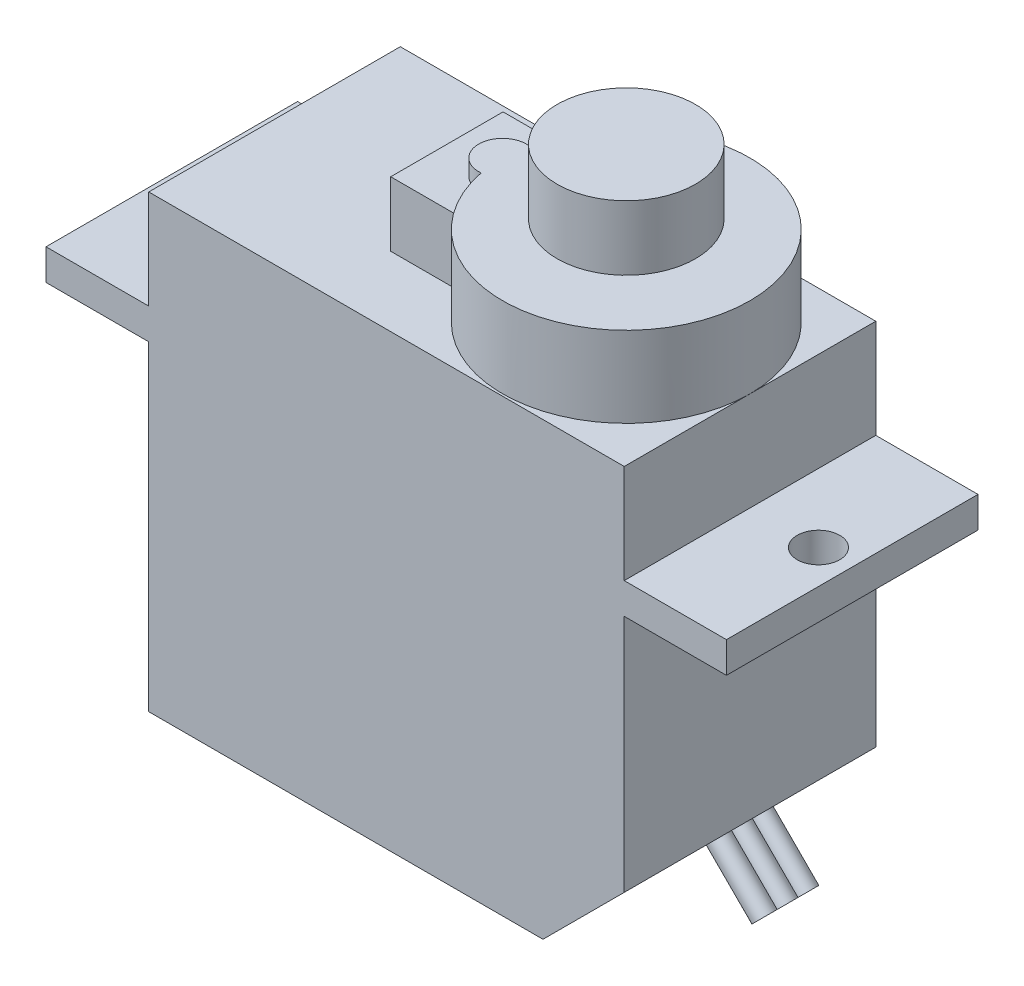
ISO-10303-21;
HEADER;
FILE_DESCRIPTION(('STEP AP214'),'2;1');
FILE_NAME('part.step','',(''),(''),'','','');
FILE_SCHEMA(('AUTOMOTIVE_DESIGN { 1 0 10303 214 1 1 1 1 }'));
ENDSEC;
DATA;
#1=APPLICATION_CONTEXT('core data for automotive mechanical design processes');
#2=APPLICATION_PROTOCOL_DEFINITION('international standard','automotive_design',2000,#1);
#3=PRODUCT_CONTEXT('',#1,'mechanical');
#4=PRODUCT('Part','Part','',(#3));
#5=PRODUCT_RELATED_PRODUCT_CATEGORY('part','',(#4));
#6=PRODUCT_DEFINITION_FORMATION('','',#4);
#7=PRODUCT_DEFINITION_CONTEXT('part definition',#1,'design');
#8=PRODUCT_DEFINITION('design','',#6,#7);
#9=PRODUCT_DEFINITION_SHAPE('','',#8);
#10=(LENGTH_UNIT() NAMED_UNIT(*) SI_UNIT(.MILLI.,.METRE.));
#11=(NAMED_UNIT(*) PLANE_ANGLE_UNIT() SI_UNIT($,.RADIAN.));
#12=(NAMED_UNIT(*) SI_UNIT($,.STERADIAN.) SOLID_ANGLE_UNIT());
#13=UNCERTAINTY_MEASURE_WITH_UNIT(LENGTH_MEASURE(1.E-05),#10,'distance_accuracy_value','');
#14=(GEOMETRIC_REPRESENTATION_CONTEXT(3) GLOBAL_UNCERTAINTY_ASSIGNED_CONTEXT((#13)) GLOBAL_UNIT_ASSIGNED_CONTEXT((#10,
#11,#12)) REPRESENTATION_CONTEXT('',''));
#15=CARTESIAN_POINT('',(0.,0.,0.));
#16=DIRECTION('',(0.,0.,1.));
#17=DIRECTION('',(1.,0.,0.));
#18=AXIS2_PLACEMENT_3D('',#15,#16,#17);
#19=CARTESIAN_POINT('',(19.12,0.,-12.2));
#20=DIRECTION('',(0.707106781186549,-0.707106781186546,0.));
#21=DIRECTION('',(0.707106781186546,0.707106781186549,0.));
#22=AXIS2_PLACEMENT_3D('',#19,#20,#21);
#23=PLANE('',#22);
#24=CARTESIAN_POINT('',(22.5615705813706,3.44157058137057,-6.1));
#25=DIRECTION('',(0.707106781186549,-0.707106781186546,0.));
#26=DIRECTION('',(0.707106781186546,0.707106781186549,0.));
#27=AXIS2_PLACEMENT_3D('',#24,#25,#26);
#28=CIRCLE('',#27,0.500000000000001);
#29=CARTESIAN_POINT('',(22.9151239719638,3.79512397196384,-6.1));
#30=VERTEX_POINT('',#29);
#31=EDGE_CURVE('E358',#30,#30,#28,.T.);
#32=ORIENTED_EDGE('',*,*,#31,.F.);
#33=EDGE_LOOP('',(#32));
#34=FACE_BOUND('',#33,.T.);
#35=DIRECTION('',(0.707106781186546,0.707106781186549,0.));
#36=VECTOR('',#35,1.);
#37=CARTESIAN_POINT('',(19.12,0.,0.));
#38=LINE('',#37,#36);
#39=CARTESIAN_POINT('',(19.12,0.,0.));
#40=VERTEX_POINT('',#39);
#41=CARTESIAN_POINT('',(23.06,3.94,0.));
#42=VERTEX_POINT('',#41);
#43=EDGE_CURVE('E305',#40,#42,#38,.T.);
#44=ORIENTED_EDGE('',*,*,#43,.F.);
#45=DIRECTION('',(0.,0.,1.));
#46=VECTOR('',#45,1.);
#47=CARTESIAN_POINT('',(19.12,0.,-12.2));
#48=LINE('',#47,#46);
#49=CARTESIAN_POINT('',(19.12,0.,-12.2));
#50=VERTEX_POINT('',#49);
#51=EDGE_CURVE('E327',#50,#40,#48,.T.);
#52=ORIENTED_EDGE('',*,*,#51,.F.);
#53=DIRECTION('',(0.707106781186546,0.707106781186549,0.));
#54=VECTOR('',#53,1.);
#55=CARTESIAN_POINT('',(19.12,0.,-12.2));
#56=LINE('',#55,#54);
#57=CARTESIAN_POINT('',(23.06,3.94,-12.2));
#58=VERTEX_POINT('',#57);
#59=EDGE_CURVE('E288',#50,#58,#56,.T.);
#60=ORIENTED_EDGE('',*,*,#59,.T.);
#61=DIRECTION('',(0.,0.,1.));
#62=VECTOR('',#61,1.);
#63=CARTESIAN_POINT('',(23.06,3.94,-12.2));
#64=LINE('',#63,#62);
#65=EDGE_CURVE('E324',#58,#42,#64,.T.);
#66=ORIENTED_EDGE('',*,*,#65,.T.);
#67=EDGE_LOOP('',(#44,#52,#60,#66));
#68=FACE_BOUND('',#67,.T.);
#69=CARTESIAN_POINT('',(22.5615705813706,3.44157058137056,-5.09));
#70=DIRECTION('',(0.707106781186549,-0.707106781186546,0.));
#71=DIRECTION('',(0.707106781186546,0.707106781186549,0.));
#72=AXIS2_PLACEMENT_3D('',#69,#70,#71);
#73=CIRCLE('',#72,0.500000000000001);
#74=CARTESIAN_POINT('',(22.9151239719638,3.79512397196384,-5.09));
#75=VERTEX_POINT('',#74);
#76=EDGE_CURVE('E351',#75,#75,#73,.T.);
#77=ORIENTED_EDGE('',*,*,#76,.F.);
#78=EDGE_LOOP('',(#77));
#79=FACE_BOUND('',#78,.T.);
#80=CARTESIAN_POINT('',(22.5615705813706,3.44157058137057,-7.11));
#81=DIRECTION('',(0.707106781186549,-0.707106781186546,0.));
#82=DIRECTION('',(0.707106781186546,0.707106781186549,0.));
#83=AXIS2_PLACEMENT_3D('',#80,#81,#82);
#84=CIRCLE('',#83,0.500000000000001);
#85=CARTESIAN_POINT('',(22.9151239719638,3.79512397196384,-7.11));
#86=VERTEX_POINT('',#85);
#87=EDGE_CURVE('E365',#86,#86,#84,.T.);
#88=ORIENTED_EDGE('',*,*,#87,.F.);
#89=EDGE_LOOP('',(#88));
#90=FACE_BOUND('',#89,.T.);
#91=ADVANCED_FACE('F40',(#34,#68,#79,#90),#23,.T.);
#92=CARTESIAN_POINT('',(17.06,28.51,-6.1));
#93=DIRECTION('',(0.,-1.,0.));
#94=DIRECTION('',(0.,0.,-1.));
#95=AXIS2_PLACEMENT_3D('',#92,#93,#94);
#96=CYLINDRICAL_SURFACE('',#95,2.345);
#97=CARTESIAN_POINT('',(17.06,25.74,-6.1));
#98=DIRECTION('',(0.,1.,0.));
#99=DIRECTION('',(0.,0.,1.));
#100=AXIS2_PLACEMENT_3D('',#97,#98,#99);
#101=CIRCLE('',#100,2.345);
#102=CARTESIAN_POINT('',(17.06,25.74,-3.755));
#103=VERTEX_POINT('',#102);
#104=EDGE_CURVE('E194',#103,#103,#101,.F.);
#105=ORIENTED_EDGE('',*,*,#104,.F.);
#106=EDGE_LOOP('',(#105));
#107=FACE_BOUND('',#106,.T.);
#108=CARTESIAN_POINT('',(17.06,26.18,-6.1));
#109=DIRECTION('',(0.,1.,0.));
#110=DIRECTION('',(0.,0.,1.));
#111=AXIS2_PLACEMENT_3D('',#108,#109,#110);
#112=CIRCLE('',#111,2.345);
#113=CARTESIAN_POINT('',(17.06,26.18,-3.755));
#114=VERTEX_POINT('',#113);
#115=EDGE_CURVE('E11',#114,#114,#112,.T.);
#116=ORIENTED_EDGE('',*,*,#115,.F.);
#117=EDGE_LOOP('',(#116));
#118=FACE_BOUND('',#117,.T.);
#119=ADVANCED_FACE('F382',(#107,#118),#96,.T.);
#120=CARTESIAN_POINT('',(17.06,25.74,-6.1));
#121=DIRECTION('',(0.,1.,0.));
#122=DIRECTION('',(0.,0.,1.));
#123=AXIS2_PLACEMENT_3D('',#120,#121,#122);
#124=PLANE('',#123);
#125=CARTESIAN_POINT('',(17.06,25.74,-6.1));
#126=DIRECTION('',(0.,1.,0.));
#127=DIRECTION('',(0.,0.,1.));
#128=AXIS2_PLACEMENT_3D('',#125,#126,#127);
#129=CIRCLE('',#128,6.);
#130=CARTESIAN_POINT('',(11.1721333333333,25.74,-4.94543249848458));
#131=VERTEX_POINT('',#130);
#132=CARTESIAN_POINT('',(11.1721333333333,25.74,-7.25456750151542));
#133=VERTEX_POINT('',#132);
#134=EDGE_CURVE('E273',#131,#133,#129,.T.);
#135=ORIENTED_EDGE('',*,*,#134,.T.);
#136=CARTESIAN_POINT('',(11.06,25.74,-6.1));
#137=DIRECTION('',(0.,1.,0.));
#138=DIRECTION('',(0.,0.,1.));
#139=AXIS2_PLACEMENT_3D('',#136,#137,#138);
#140=CIRCLE('',#139,1.16);
#141=EDGE_CURVE('E211',#133,#131,#140,.T.);
#142=ORIENTED_EDGE('',*,*,#141,.T.);
#143=EDGE_LOOP('',(#135,#142));
#144=FACE_BOUND('',#143,.T.);
#145=ORIENTED_EDGE('',*,*,#104,.T.);
#146=EDGE_LOOP('',(#145));
#147=FACE_BOUND('',#146,.T.);
#148=ADVANCED_FACE('F388',(#144,#147),#124,.T.);
#149=CARTESIAN_POINT('',(0.,21.83,-12.2));
#150=DIRECTION('',(0.,1.,0.));
#151=DIRECTION('',(0.,0.,1.));
#152=AXIS2_PLACEMENT_3D('',#149,#150,#151);
#153=PLANE('',#152);
#154=CARTESIAN_POINT('',(17.06,21.83,-6.1));
#155=DIRECTION('',(0.,1.,0.));
#156=DIRECTION('',(0.,0.,1.));
#157=AXIS2_PLACEMENT_3D('',#154,#155,#156);
#158=CIRCLE('',#157,6.);
#159=CARTESIAN_POINT('',(23.06,21.83,-6.1));
#160=VERTEX_POINT('',#159);
#161=CARTESIAN_POINT('',(11.7144995557011,21.83,-3.375));
#162=VERTEX_POINT('',#161);
#163=EDGE_CURVE('E277',#160,#162,#158,.F.);
#164=ORIENTED_EDGE('',*,*,#163,.T.);
#165=DIRECTION('',(-1.,0.,0.));
#166=VECTOR('',#165,1.);
#167=CARTESIAN_POINT('',(0.,21.83,-3.375));
#168=LINE('',#167,#166);
#169=CARTESIAN_POINT('',(8.36,21.83,-3.375));
#170=VERTEX_POINT('',#169);
#171=EDGE_CURVE('E209',#162,#170,#168,.T.);
#172=ORIENTED_EDGE('',*,*,#171,.T.);
#173=DIRECTION('',(0.,0.,-1.));
#174=VECTOR('',#173,1.);
#175=CARTESIAN_POINT('',(8.36,21.83,-12.2));
#176=LINE('',#175,#174);
#177=CARTESIAN_POINT('',(8.36,21.83,-8.825));
#178=VERTEX_POINT('',#177);
#179=EDGE_CURVE('E198',#170,#178,#176,.T.);
#180=ORIENTED_EDGE('',*,*,#179,.T.);
#181=DIRECTION('',(1.,0.,0.));
#182=VECTOR('',#181,1.);
#183=CARTESIAN_POINT('',(0.,21.83,-8.825));
#184=LINE('',#183,#182);
#185=CARTESIAN_POINT('',(11.7144995557011,21.83,-8.825));
#186=VERTEX_POINT('',#185);
#187=EDGE_CURVE('E206',#178,#186,#184,.T.);
#188=ORIENTED_EDGE('',*,*,#187,.T.);
#189=EDGE_CURVE('E276',#186,#160,#158,.F.);
#190=ORIENTED_EDGE('',*,*,#189,.T.);
#191=DIRECTION('',(0.,0.,1.));
#192=VECTOR('',#191,1.);
#193=CARTESIAN_POINT('',(23.06,21.83,-12.2));
#194=LINE('',#193,#192);
#195=CARTESIAN_POINT('',(23.06,21.83,-12.2));
#196=VERTEX_POINT('',#195);
#197=EDGE_CURVE('E320',#196,#160,#194,.T.);
#198=ORIENTED_EDGE('',*,*,#197,.F.);
#199=DIRECTION('',(-1.,0.,0.));
#200=VECTOR('',#199,1.);
#201=CARTESIAN_POINT('',(0.,21.83,-12.2));
#202=LINE('',#201,#200);
#203=CARTESIAN_POINT('',(0.,21.83,-12.2));
#204=VERTEX_POINT('',#203);
#205=EDGE_CURVE('E295',#196,#204,#202,.T.);
#206=ORIENTED_EDGE('',*,*,#205,.T.);
#207=DIRECTION('',(0.,0.,1.));
#208=VECTOR('',#207,1.);
#209=CARTESIAN_POINT('',(0.,21.83,-12.2));
#210=LINE('',#209,#208);
#211=CARTESIAN_POINT('',(0.,21.83,0.));
#212=VERTEX_POINT('',#211);
#213=EDGE_CURVE('E317',#204,#212,#210,.T.);
#214=ORIENTED_EDGE('',*,*,#213,.T.);
#215=DIRECTION('',(-1.,0.,0.));
#216=VECTOR('',#215,1.);
#217=CARTESIAN_POINT('',(0.,21.83,0.));
#218=LINE('',#217,#216);
#219=CARTESIAN_POINT('',(23.06,21.83,0.));
#220=VERTEX_POINT('',#219);
#221=EDGE_CURVE('E314',#220,#212,#218,.T.);
#222=ORIENTED_EDGE('',*,*,#221,.F.);
#223=EDGE_CURVE('E323',#160,#220,#194,.T.);
#224=ORIENTED_EDGE('',*,*,#223,.F.);
#225=EDGE_LOOP('',(#164,#172,#180,#188,#190,#198,#206,#214,#222,#224));
#226=FACE_BOUND('',#225,.T.);
#227=ADVANCED_FACE('F446',(#226),#153,.T.);
#228=CARTESIAN_POINT('',(17.06,25.74,-6.1));
#229=DIRECTION('',(0.,-1.,0.));
#230=DIRECTION('',(0.,0.,-1.));
#231=AXIS2_PLACEMENT_3D('',#228,#229,#230);
#232=CYLINDRICAL_SURFACE('',#231,6.);
#233=DIRECTION('',(0.,-1.,0.));
#234=VECTOR('',#233,1.);
#235=CARTESIAN_POINT('',(11.7144995557011,25.74,-8.825));
#236=LINE('',#235,#234);
#237=CARTESIAN_POINT('',(11.7144995557011,24.96,-8.825));
#238=VERTEX_POINT('',#237);
#239=EDGE_CURVE('E333',#238,#186,#236,.T.);
#240=ORIENTED_EDGE('',*,*,#239,.F.);
#241=CARTESIAN_POINT('',(17.06,24.96,-6.1));
#242=DIRECTION('',(0.,1.,0.));
#243=DIRECTION('',(0.,0.,1.));
#244=AXIS2_PLACEMENT_3D('',#241,#242,#243);
#245=CIRCLE('',#244,6.);
#246=CARTESIAN_POINT('',(11.1721333333333,24.96,-7.25456750151542));
#247=VERTEX_POINT('',#246);
#248=EDGE_CURVE('E201',#238,#247,#245,.T.);
#249=ORIENTED_EDGE('',*,*,#248,.T.);
#250=DIRECTION('',(0.,-1.,0.));
#251=VECTOR('',#250,1.);
#252=CARTESIAN_POINT('',(11.1721333333333,21.37,-7.25456750151542));
#253=LINE('',#252,#251);
#254=EDGE_CURVE('E214',#133,#247,#253,.T.);
#255=ORIENTED_EDGE('',*,*,#254,.F.);
#256=ORIENTED_EDGE('',*,*,#134,.F.);
#257=DIRECTION('',(0.,-1.,0.));
#258=VECTOR('',#257,1.);
#259=CARTESIAN_POINT('',(11.1721333333333,21.37,-4.94543249848458));
#260=LINE('',#259,#258);
#261=CARTESIAN_POINT('',(11.1721333333333,24.96,-4.94543249848458));
#262=VERTEX_POINT('',#261);
#263=EDGE_CURVE('E64',#262,#131,#260,.F.);
#264=ORIENTED_EDGE('',*,*,#263,.F.);
#265=CARTESIAN_POINT('',(11.7144995557011,24.96,-3.375));
#266=VERTEX_POINT('',#265);
#267=EDGE_CURVE('E57',#262,#266,#245,.T.);
#268=ORIENTED_EDGE('',*,*,#267,.T.);
#269=DIRECTION('',(0.,-1.,0.));
#270=VECTOR('',#269,1.);
#271=CARTESIAN_POINT('',(11.7144995557011,25.74,-3.375));
#272=LINE('',#271,#270);
#273=EDGE_CURVE('E184',#162,#266,#272,.F.);
#274=ORIENTED_EDGE('',*,*,#273,.F.);
#275=ORIENTED_EDGE('',*,*,#163,.F.);
#276=ORIENTED_EDGE('',*,*,#189,.F.);
#277=EDGE_LOOP('',(#240,#249,#255,#256,#264,#268,#274,#275,#276));
#278=FACE_BOUND('',#277,.T.);
#279=ADVANCED_FACE('F512',(#278),#232,.T.);
#280=CARTESIAN_POINT('',(0.,0.,-12.2));
#281=DIRECTION('',(-1.,0.,0.));
#282=DIRECTION('',(0.,0.,1.));
#283=AXIS2_PLACEMENT_3D('',#280,#281,#282);
#284=PLANE('',#283);
#285=DIRECTION('',(0.,0.,-1.));
#286=VECTOR('',#285,1.);
#287=CARTESIAN_POINT('',(0.,17.0352801000834,-12.2));
#288=LINE('',#287,#286);
#289=CARTESIAN_POINT('',(0.,17.0352801000834,0.));
#290=VERTEX_POINT('',#289);
#291=CARTESIAN_POINT('',(0.,17.0352801000834,-12.2));
#292=VERTEX_POINT('',#291);
#293=EDGE_CURVE('E271',#290,#292,#288,.T.);
#294=ORIENTED_EDGE('',*,*,#293,.F.);
#295=DIRECTION('',(0.,-1.,0.));
#296=VECTOR('',#295,1.);
#297=CARTESIAN_POINT('',(0.,0.,0.));
#298=LINE('',#297,#296);
#299=EDGE_CURVE('E299',#212,#290,#298,.T.);
#300=ORIENTED_EDGE('',*,*,#299,.F.);
#301=ORIENTED_EDGE('',*,*,#213,.F.);
#302=DIRECTION('',(0.,-1.,0.));
#303=VECTOR('',#302,1.);
#304=CARTESIAN_POINT('',(0.,0.,-12.2));
#305=LINE('',#304,#303);
#306=EDGE_CURVE('E281',#204,#292,#305,.T.);
#307=ORIENTED_EDGE('',*,*,#306,.T.);
#308=EDGE_LOOP('',(#294,#300,#301,#307));
#309=FACE_BOUND('',#308,.T.);
#310=ADVANCED_FACE('F452',(#309),#284,.T.);
#311=CARTESIAN_POINT('',(23.06,3.94,-12.2));
#312=DIRECTION('',(1.,0.,0.));
#313=DIRECTION('',(0.,0.,-1.));
#314=AXIS2_PLACEMENT_3D('',#311,#312,#313);
#315=PLANE('',#314);
#316=DIRECTION('',(0.,0.,1.));
#317=VECTOR('',#316,1.);
#318=CARTESIAN_POINT('',(23.06,17.0352801000834,-12.2));
#319=LINE('',#318,#317);
#320=CARTESIAN_POINT('',(23.06,17.0352801000834,-12.2));
#321=VERTEX_POINT('',#320);
#322=CARTESIAN_POINT('',(23.06,17.0352801000834,0.));
#323=VERTEX_POINT('',#322);
#324=EDGE_CURVE('E268',#321,#323,#319,.T.);
#325=ORIENTED_EDGE('',*,*,#324,.F.);
#326=DIRECTION('',(0.,1.,0.));
#327=VECTOR('',#326,1.);
#328=CARTESIAN_POINT('',(23.06,3.94,-12.2));
#329=LINE('',#328,#327);
#330=EDGE_CURVE('E291',#321,#196,#329,.T.);
#331=ORIENTED_EDGE('',*,*,#330,.T.);
#332=ORIENTED_EDGE('',*,*,#197,.T.);
#333=ORIENTED_EDGE('',*,*,#223,.T.);
#334=DIRECTION('',(0.,1.,0.));
#335=VECTOR('',#334,1.);
#336=CARTESIAN_POINT('',(23.06,3.94,0.));
#337=LINE('',#336,#335);
#338=EDGE_CURVE('E309',#323,#220,#337,.T.);
#339=ORIENTED_EDGE('',*,*,#338,.F.);
#340=EDGE_LOOP('',(#325,#331,#332,#333,#339));
#341=FACE_BOUND('',#340,.T.);
#342=ADVANCED_FACE('F408',(#341),#315,.T.);
#343=DIRECTION('',(0.,0.,1.));
#344=VECTOR('',#343,1.);
#345=CARTESIAN_POINT('',(0.,15.5352801000834,-12.2));
#346=LINE('',#345,#344);
#347=CARTESIAN_POINT('',(0.,15.5352801000834,-12.2));
#348=VERTEX_POINT('',#347);
#349=CARTESIAN_POINT('',(0.,15.5352801000834,0.));
#350=VERTEX_POINT('',#349);
#351=EDGE_CURVE('E265',#348,#350,#346,.T.);
#352=ORIENTED_EDGE('',*,*,#351,.F.);
#353=CARTESIAN_POINT('',(0.,0.,-12.2));
#354=VERTEX_POINT('',#353);
#355=EDGE_CURVE('E285',#348,#354,#305,.T.);
#356=ORIENTED_EDGE('',*,*,#355,.T.);
#357=DIRECTION('',(0.,0.,1.));
#358=VECTOR('',#357,1.);
#359=CARTESIAN_POINT('',(0.,0.,-12.2));
#360=LINE('',#359,#358);
#361=CARTESIAN_POINT('',(0.,0.,0.));
#362=VERTEX_POINT('',#361);
#363=EDGE_CURVE('E298',#354,#362,#360,.T.);
#364=ORIENTED_EDGE('',*,*,#363,.T.);
#365=EDGE_CURVE('E280',#350,#362,#298,.T.);
#366=ORIENTED_EDGE('',*,*,#365,.F.);
#367=EDGE_LOOP('',(#352,#356,#364,#366));
#368=FACE_BOUND('',#367,.T.);
#369=ADVANCED_FACE('F42',(#368),#284,.T.);
#370=DIRECTION('',(0.,0.,-1.));
#371=VECTOR('',#370,1.);
#372=CARTESIAN_POINT('',(23.06,15.5352801000834,-12.2));
#373=LINE('',#372,#371);
#374=CARTESIAN_POINT('',(23.06,15.5352801000834,0.));
#375=VERTEX_POINT('',#374);
#376=CARTESIAN_POINT('',(23.06,15.5352801000834,-12.2));
#377=VERTEX_POINT('',#376);
#378=EDGE_CURVE('E253',#375,#377,#373,.T.);
#379=ORIENTED_EDGE('',*,*,#378,.F.);
#380=EDGE_CURVE('E310',#42,#375,#337,.T.);
#381=ORIENTED_EDGE('',*,*,#380,.F.);
#382=ORIENTED_EDGE('',*,*,#65,.F.);
#383=EDGE_CURVE('E292',#58,#377,#329,.T.);
#384=ORIENTED_EDGE('',*,*,#383,.T.);
#385=EDGE_LOOP('',(#379,#381,#382,#384));
#386=FACE_BOUND('',#385,.T.);
#387=ADVANCED_FACE('F394',(#386),#315,.T.);
#388=CARTESIAN_POINT('',(0.,0.,-12.2));
#389=DIRECTION('',(0.,-1.,0.));
#390=DIRECTION('',(1.,0.,0.));
#391=AXIS2_PLACEMENT_3D('',#388,#389,#390);
#392=PLANE('',#391);
#393=DIRECTION('',(1.,0.,0.));
#394=VECTOR('',#393,1.);
#395=CARTESIAN_POINT('',(0.,0.,0.));
#396=LINE('',#395,#394);
#397=EDGE_CURVE('E302',#362,#40,#396,.T.);
#398=ORIENTED_EDGE('',*,*,#397,.F.);
#399=ORIENTED_EDGE('',*,*,#363,.F.);
#400=DIRECTION('',(1.,0.,0.));
#401=VECTOR('',#400,1.);
#402=CARTESIAN_POINT('',(0.,0.,-12.2));
#403=LINE('',#402,#401);
#404=EDGE_CURVE('E284',#354,#50,#403,.T.);
#405=ORIENTED_EDGE('',*,*,#404,.T.);
#406=ORIENTED_EDGE('',*,*,#51,.T.);
#407=EDGE_LOOP('',(#398,#399,#405,#406));
#408=FACE_BOUND('',#407,.T.);
#409=ADVANCED_FACE('F396',(#408),#392,.T.);
#410=CARTESIAN_POINT('',(0.,0.,-12.2));
#411=DIRECTION('',(0.,0.,-1.));
#412=DIRECTION('',(-1.,0.,0.));
#413=AXIS2_PLACEMENT_3D('',#410,#411,#412);
#414=PLANE('',#413);
#415=ORIENTED_EDGE('',*,*,#355,.F.);
#416=DIRECTION('',(1.,0.,0.));
#417=VECTOR('',#416,1.);
#418=CARTESIAN_POINT('',(-4.98290250208507,15.5352801000834,-12.2));
#419=LINE('',#418,#417);
#420=CARTESIAN_POINT('',(-4.98290250208507,15.5352801000834,-12.2));
#421=VERTEX_POINT('',#420);
#422=EDGE_CURVE('E231',#421,#348,#419,.T.);
#423=ORIENTED_EDGE('',*,*,#422,.F.);
#424=DIRECTION('',(0.,-1.,0.));
#425=VECTOR('',#424,1.);
#426=CARTESIAN_POINT('',(-4.98290250208507,15.5352801000834,-12.2));
#427=LINE('',#426,#425);
#428=CARTESIAN_POINT('',(-4.98290250208507,17.0352801000834,-12.2));
#429=VERTEX_POINT('',#428);
#430=EDGE_CURVE('E226',#429,#421,#427,.T.);
#431=ORIENTED_EDGE('',*,*,#430,.F.);
#432=DIRECTION('',(-1.,0.,0.));
#433=VECTOR('',#432,1.);
#434=CARTESIAN_POINT('',(-4.98290250208507,17.0352801000834,-12.2));
#435=LINE('',#434,#433);
#436=EDGE_CURVE('E236',#292,#429,#435,.T.);
#437=ORIENTED_EDGE('',*,*,#436,.F.);
#438=ORIENTED_EDGE('',*,*,#306,.F.);
#439=ORIENTED_EDGE('',*,*,#205,.F.);
#440=ORIENTED_EDGE('',*,*,#330,.F.);
#441=CARTESIAN_POINT('',(28.0170974979149,17.0352801000834,-12.2));
#442=VERTEX_POINT('',#441);
#443=EDGE_CURVE('E237',#442,#321,#435,.T.);
#444=ORIENTED_EDGE('',*,*,#443,.F.);
#445=DIRECTION('',(0.,1.,0.));
#446=VECTOR('',#445,1.);
#447=CARTESIAN_POINT('',(28.0170974979149,15.5352801000834,-12.2));
#448=LINE('',#447,#446);
#449=CARTESIAN_POINT('',(28.0170974979149,15.5352801000834,-12.2));
#450=VERTEX_POINT('',#449);
#451=EDGE_CURVE('E233',#450,#442,#448,.T.);
#452=ORIENTED_EDGE('',*,*,#451,.F.);
#453=EDGE_CURVE('E229',#377,#450,#419,.T.);
#454=ORIENTED_EDGE('',*,*,#453,.F.);
#455=ORIENTED_EDGE('',*,*,#383,.F.);
#456=ORIENTED_EDGE('',*,*,#59,.F.);
#457=ORIENTED_EDGE('',*,*,#404,.F.);
#458=EDGE_LOOP('',(#415,#423,#431,#437,#438,#439,#440,#444,#452,#454,#455,#456,#457));
#459=FACE_BOUND('',#458,.T.);
#460=ADVANCED_FACE('F398',(#459),#414,.T.);
#461=CARTESIAN_POINT('',(0.,0.,0.));
#462=DIRECTION('',(0.,0.,-1.));
#463=DIRECTION('',(-1.,0.,0.));
#464=AXIS2_PLACEMENT_3D('',#461,#462,#463);
#465=PLANE('',#464);
#466=ORIENTED_EDGE('',*,*,#380,.T.);
#467=DIRECTION('',(1.,0.,0.));
#468=VECTOR('',#467,1.);
#469=CARTESIAN_POINT('',(-4.98290250208507,15.5352801000834,0.));
#470=LINE('',#469,#468);
#471=CARTESIAN_POINT('',(28.0170974979149,15.5352801000834,0.));
#472=VERTEX_POINT('',#471);
#473=EDGE_CURVE('E242',#375,#472,#470,.T.);
#474=ORIENTED_EDGE('',*,*,#473,.T.);
#475=DIRECTION('',(0.,1.,0.));
#476=VECTOR('',#475,1.);
#477=CARTESIAN_POINT('',(28.0170974979149,15.5352801000834,0.));
#478=LINE('',#477,#476);
#479=CARTESIAN_POINT('',(28.0170974979149,17.0352801000834,0.));
#480=VERTEX_POINT('',#479);
#481=EDGE_CURVE('E245',#472,#480,#478,.T.);
#482=ORIENTED_EDGE('',*,*,#481,.T.);
#483=DIRECTION('',(-1.,0.,0.));
#484=VECTOR('',#483,1.);
#485=CARTESIAN_POINT('',(-4.98290250208507,17.0352801000834,0.));
#486=LINE('',#485,#484);
#487=EDGE_CURVE('E230',#480,#323,#486,.T.);
#488=ORIENTED_EDGE('',*,*,#487,.T.);
#489=ORIENTED_EDGE('',*,*,#338,.T.);
#490=ORIENTED_EDGE('',*,*,#221,.T.);
#491=ORIENTED_EDGE('',*,*,#299,.T.);
#492=CARTESIAN_POINT('',(-4.98290250208507,17.0352801000834,0.));
#493=VERTEX_POINT('',#492);
#494=EDGE_CURVE('E248',#290,#493,#486,.T.);
#495=ORIENTED_EDGE('',*,*,#494,.T.);
#496=DIRECTION('',(0.,-1.,0.));
#497=VECTOR('',#496,1.);
#498=CARTESIAN_POINT('',(-4.98290250208507,15.5352801000834,0.));
#499=LINE('',#498,#497);
#500=CARTESIAN_POINT('',(-4.98290250208507,15.5352801000834,0.));
#501=VERTEX_POINT('',#500);
#502=EDGE_CURVE('E225',#493,#501,#499,.T.);
#503=ORIENTED_EDGE('',*,*,#502,.T.);
#504=EDGE_CURVE('E243',#501,#350,#470,.T.);
#505=ORIENTED_EDGE('',*,*,#504,.T.);
#506=ORIENTED_EDGE('',*,*,#365,.T.);
#507=ORIENTED_EDGE('',*,*,#397,.T.);
#508=ORIENTED_EDGE('',*,*,#43,.T.);
#509=EDGE_LOOP('',(#466,#474,#482,#488,#489,#490,#491,#495,#503,#505,#506,#507,#508));
#510=FACE_BOUND('',#509,.T.);
#511=ADVANCED_FACE('F404',(#510),#465,.F.);
#512=CARTESIAN_POINT('',(26.38,0.,-6.1));
#513=DIRECTION('',(0.,1.,0.));
#514=DIRECTION('',(0.,0.,1.));
#515=AXIS2_PLACEMENT_3D('',#512,#513,#514);
#516=CYLINDRICAL_SURFACE('',#515,1.03);
#517=CARTESIAN_POINT('',(26.38,17.0352801000834,-6.1));
#518=DIRECTION('',(0.,1.,0.));
#519=DIRECTION('',(0.,0.,1.));
#520=AXIS2_PLACEMENT_3D('',#517,#518,#519);
#521=CIRCLE('',#520,1.03);
#522=CARTESIAN_POINT('',(26.38,17.0352801000834,-5.07));
#523=VERTEX_POINT('',#522);
#524=EDGE_CURVE('E218',#523,#523,#521,.T.);
#525=ORIENTED_EDGE('',*,*,#524,.T.);
#526=EDGE_LOOP('',(#525));
#527=FACE_BOUND('',#526,.T.);
#528=CARTESIAN_POINT('',(26.38,15.5352801000834,-6.1));
#529=DIRECTION('',(0.,-1.,0.));
#530=DIRECTION('',(0.,0.,-1.));
#531=AXIS2_PLACEMENT_3D('',#528,#529,#530);
#532=CIRCLE('',#531,1.03);
#533=CARTESIAN_POINT('',(26.38,15.5352801000834,-7.13));
#534=VERTEX_POINT('',#533);
#535=EDGE_CURVE('E217',#534,#534,#532,.T.);
#536=ORIENTED_EDGE('',*,*,#535,.T.);
#537=EDGE_LOOP('',(#536));
#538=FACE_BOUND('',#537,.T.);
#539=ADVANCED_FACE('F482',(#527,#538),#516,.F.);
#540=CARTESIAN_POINT('',(28.0170974979149,15.5352801000834,-12.2));
#541=DIRECTION('',(1.,0.,0.));
#542=DIRECTION('',(0.,0.,-1.));
#543=AXIS2_PLACEMENT_3D('',#540,#541,#542);
#544=PLANE('',#543);
#545=ORIENTED_EDGE('',*,*,#481,.F.);
#546=DIRECTION('',(0.,0.,1.));
#547=VECTOR('',#546,1.);
#548=CARTESIAN_POINT('',(28.0170974979149,15.5352801000834,-12.2));
#549=LINE('',#548,#547);
#550=EDGE_CURVE('E256',#450,#472,#549,.T.);
#551=ORIENTED_EDGE('',*,*,#550,.F.);
#552=ORIENTED_EDGE('',*,*,#451,.T.);
#553=DIRECTION('',(0.,0.,1.));
#554=VECTOR('',#553,1.);
#555=CARTESIAN_POINT('',(28.0170974979149,17.0352801000834,-12.2));
#556=LINE('',#555,#554);
#557=EDGE_CURVE('E254',#442,#480,#556,.T.);
#558=ORIENTED_EDGE('',*,*,#557,.T.);
#559=EDGE_LOOP('',(#545,#551,#552,#558));
#560=FACE_BOUND('',#559,.T.);
#561=ADVANCED_FACE('F434',(#560),#544,.T.);
#562=CARTESIAN_POINT('',(-4.98290250208507,15.5352801000834,-12.2));
#563=DIRECTION('',(0.,-1.,0.));
#564=DIRECTION('',(0.,0.,-1.));
#565=AXIS2_PLACEMENT_3D('',#562,#563,#564);
#566=PLANE('',#565);
#567=ORIENTED_EDGE('',*,*,#535,.F.);
#568=EDGE_LOOP('',(#567));
#569=FACE_BOUND('',#568,.T.);
#570=ORIENTED_EDGE('',*,*,#473,.F.);
#571=ORIENTED_EDGE('',*,*,#378,.T.);
#572=ORIENTED_EDGE('',*,*,#453,.T.);
#573=ORIENTED_EDGE('',*,*,#550,.T.);
#574=EDGE_LOOP('',(#570,#571,#572,#573));
#575=FACE_BOUND('',#574,.T.);
#576=ADVANCED_FACE('F431',(#569,#575),#566,.T.);
#577=CARTESIAN_POINT('',(-4.98290250208507,17.0352801000834,-12.2));
#578=DIRECTION('',(0.,1.,0.));
#579=DIRECTION('',(0.,0.,1.));
#580=AXIS2_PLACEMENT_3D('',#577,#578,#579);
#581=PLANE('',#580);
#582=ORIENTED_EDGE('',*,*,#524,.F.);
#583=EDGE_LOOP('',(#582));
#584=FACE_BOUND('',#583,.T.);
#585=ORIENTED_EDGE('',*,*,#443,.T.);
#586=ORIENTED_EDGE('',*,*,#324,.T.);
#587=ORIENTED_EDGE('',*,*,#487,.F.);
#588=ORIENTED_EDGE('',*,*,#557,.F.);
#589=EDGE_LOOP('',(#585,#586,#587,#588));
#590=FACE_BOUND('',#589,.T.);
#591=ADVANCED_FACE('F437',(#584,#590),#581,.T.);
#592=CARTESIAN_POINT('',(-3.31,17.0352801000834,-6.1));
#593=DIRECTION('',(0.,1.,0.));
#594=DIRECTION('',(0.,0.,1.));
#595=AXIS2_PLACEMENT_3D('',#592,#593,#594);
#596=CIRCLE('',#595,1.03);
#597=CARTESIAN_POINT('',(-3.31,17.0352801000834,-5.07));
#598=VERTEX_POINT('',#597);
#599=EDGE_CURVE('E222',#598,#598,#596,.T.);
#600=ORIENTED_EDGE('',*,*,#599,.F.);
#601=EDGE_LOOP('',(#600));
#602=FACE_BOUND('',#601,.T.);
#603=ORIENTED_EDGE('',*,*,#494,.F.);
#604=ORIENTED_EDGE('',*,*,#293,.T.);
#605=ORIENTED_EDGE('',*,*,#436,.T.);
#606=DIRECTION('',(0.,0.,1.));
#607=VECTOR('',#606,1.);
#608=CARTESIAN_POINT('',(-4.98290250208507,17.0352801000834,-12.2));
#609=LINE('',#608,#607);
#610=EDGE_CURVE('E250',#429,#493,#609,.T.);
#611=ORIENTED_EDGE('',*,*,#610,.T.);
#612=EDGE_LOOP('',(#603,#604,#605,#611));
#613=FACE_BOUND('',#612,.T.);
#614=ADVANCED_FACE('F456',(#602,#613),#581,.T.);
#615=CARTESIAN_POINT('',(-3.31,15.5352801000834,-6.1));
#616=DIRECTION('',(0.,-1.,0.));
#617=DIRECTION('',(0.,0.,-1.));
#618=AXIS2_PLACEMENT_3D('',#615,#616,#617);
#619=CIRCLE('',#618,1.03);
#620=CARTESIAN_POINT('',(-3.31,15.5352801000834,-7.13));
#621=VERTEX_POINT('',#620);
#622=EDGE_CURVE('E221',#621,#621,#619,.T.);
#623=ORIENTED_EDGE('',*,*,#622,.F.);
#624=EDGE_LOOP('',(#623));
#625=FACE_BOUND('',#624,.T.);
#626=ORIENTED_EDGE('',*,*,#422,.T.);
#627=ORIENTED_EDGE('',*,*,#351,.T.);
#628=ORIENTED_EDGE('',*,*,#504,.F.);
#629=DIRECTION('',(0.,0.,1.));
#630=VECTOR('',#629,1.);
#631=CARTESIAN_POINT('',(-4.98290250208507,15.5352801000834,-12.2));
#632=LINE('',#631,#630);
#633=EDGE_CURVE('E239',#421,#501,#632,.T.);
#634=ORIENTED_EDGE('',*,*,#633,.F.);
#635=EDGE_LOOP('',(#626,#627,#628,#634));
#636=FACE_BOUND('',#635,.T.);
#637=ADVANCED_FACE('F461',(#625,#636),#566,.T.);
#638=CARTESIAN_POINT('',(-4.98290250208507,15.5352801000834,-12.2));
#639=DIRECTION('',(-1.,0.,0.));
#640=DIRECTION('',(0.,0.,1.));
#641=AXIS2_PLACEMENT_3D('',#638,#639,#640);
#642=PLANE('',#641);
#643=ORIENTED_EDGE('',*,*,#502,.F.);
#644=ORIENTED_EDGE('',*,*,#610,.F.);
#645=ORIENTED_EDGE('',*,*,#430,.T.);
#646=ORIENTED_EDGE('',*,*,#633,.T.);
#647=EDGE_LOOP('',(#643,#644,#645,#646));
#648=FACE_BOUND('',#647,.T.);
#649=ADVANCED_FACE('F459',(#648),#642,.T.);
#650=CARTESIAN_POINT('',(-3.31,0.,-6.1));
#651=DIRECTION('',(0.,1.,0.));
#652=DIRECTION('',(0.,0.,1.));
#653=AXIS2_PLACEMENT_3D('',#650,#651,#652);
#654=CYLINDRICAL_SURFACE('',#653,1.03);
#655=ORIENTED_EDGE('',*,*,#599,.T.);
#656=EDGE_LOOP('',(#655));
#657=FACE_BOUND('',#656,.T.);
#658=ORIENTED_EDGE('',*,*,#622,.T.);
#659=EDGE_LOOP('',(#658));
#660=FACE_BOUND('',#659,.T.);
#661=ADVANCED_FACE('F469',(#657,#660),#654,.F.);
#662=CARTESIAN_POINT('',(11.06,25.74,-6.1));
#663=DIRECTION('',(0.,-1.,0.));
#664=DIRECTION('',(0.,0.,-1.));
#665=AXIS2_PLACEMENT_3D('',#662,#663,#664);
#666=CYLINDRICAL_SURFACE('',#665,1.16);
#667=ORIENTED_EDGE('',*,*,#254,.T.);
#668=CARTESIAN_POINT('',(11.06,24.96,-6.1));
#669=DIRECTION('',(0.,1.,0.));
#670=DIRECTION('',(0.,0.,1.));
#671=AXIS2_PLACEMENT_3D('',#668,#669,#670);
#672=CIRCLE('',#671,1.16);
#673=EDGE_CURVE('E319',#247,#262,#672,.T.);
#674=ORIENTED_EDGE('',*,*,#673,.T.);
#675=ORIENTED_EDGE('',*,*,#263,.T.);
#676=ORIENTED_EDGE('',*,*,#141,.F.);
#677=EDGE_LOOP('',(#667,#674,#675,#676));
#678=FACE_BOUND('',#677,.T.);
#679=ADVANCED_FACE('F494',(#678),#666,.T.);
#680=CARTESIAN_POINT('',(0.,24.96,0.));
#681=DIRECTION('',(0.,1.,0.));
#682=DIRECTION('',(0.,0.,1.));
#683=AXIS2_PLACEMENT_3D('',#680,#681,#682);
#684=PLANE('',#683);
#685=ORIENTED_EDGE('',*,*,#248,.F.);
#686=DIRECTION('',(-1.,0.,0.));
#687=VECTOR('',#686,1.);
#688=CARTESIAN_POINT('',(13.76,24.96,-8.825));
#689=LINE('',#688,#687);
#690=CARTESIAN_POINT('',(8.36,24.96,-8.825));
#691=VERTEX_POINT('',#690);
#692=EDGE_CURVE('E185',#238,#691,#689,.T.);
#693=ORIENTED_EDGE('',*,*,#692,.T.);
#694=DIRECTION('',(0.,0.,1.));
#695=VECTOR('',#694,1.);
#696=CARTESIAN_POINT('',(8.36,24.96,-3.375));
#697=LINE('',#696,#695);
#698=CARTESIAN_POINT('',(8.36,24.96,-3.375));
#699=VERTEX_POINT('',#698);
#700=EDGE_CURVE('E186',#691,#699,#697,.T.);
#701=ORIENTED_EDGE('',*,*,#700,.T.);
#702=DIRECTION('',(1.,0.,0.));
#703=VECTOR('',#702,1.);
#704=CARTESIAN_POINT('',(13.76,24.96,-3.375));
#705=LINE('',#704,#703);
#706=EDGE_CURVE('E177',#699,#266,#705,.T.);
#707=ORIENTED_EDGE('',*,*,#706,.T.);
#708=ORIENTED_EDGE('',*,*,#267,.F.);
#709=ORIENTED_EDGE('',*,*,#673,.F.);
#710=EDGE_LOOP('',(#685,#693,#701,#707,#708,#709));
#711=FACE_BOUND('',#710,.T.);
#712=ADVANCED_FACE('F189',(#711),#684,.T.);
#713=CARTESIAN_POINT('',(8.36,24.96,-3.375));
#714=DIRECTION('',(1.,0.,0.));
#715=DIRECTION('',(0.,0.,-1.));
#716=AXIS2_PLACEMENT_3D('',#713,#714,#715);
#717=PLANE('',#716);
#718=ORIENTED_EDGE('',*,*,#179,.F.);
#719=DIRECTION('',(0.,-1.,0.));
#720=VECTOR('',#719,1.);
#721=CARTESIAN_POINT('',(8.36,24.96,-3.375));
#722=LINE('',#721,#720);
#723=EDGE_CURVE('E181',#699,#170,#722,.T.);
#724=ORIENTED_EDGE('',*,*,#723,.F.);
#725=ORIENTED_EDGE('',*,*,#700,.F.);
#726=DIRECTION('',(0.,-1.,0.));
#727=VECTOR('',#726,1.);
#728=CARTESIAN_POINT('',(8.36,24.96,-8.825));
#729=LINE('',#728,#727);
#730=EDGE_CURVE('E199',#691,#178,#729,.T.);
#731=ORIENTED_EDGE('',*,*,#730,.T.);
#732=EDGE_LOOP('',(#718,#724,#725,#731));
#733=FACE_BOUND('',#732,.T.);
#734=ADVANCED_FACE('F196',(#733),#717,.F.);
#735=CARTESIAN_POINT('',(13.76,24.96,-3.375));
#736=DIRECTION('',(0.,0.,-1.));
#737=DIRECTION('',(-1.,0.,0.));
#738=AXIS2_PLACEMENT_3D('',#735,#736,#737);
#739=PLANE('',#738);
#740=ORIENTED_EDGE('',*,*,#171,.F.);
#741=ORIENTED_EDGE('',*,*,#273,.T.);
#742=ORIENTED_EDGE('',*,*,#706,.F.);
#743=ORIENTED_EDGE('',*,*,#723,.T.);
#744=EDGE_LOOP('',(#740,#741,#742,#743));
#745=FACE_BOUND('',#744,.T.);
#746=ADVANCED_FACE('F179',(#745),#739,.F.);
#747=CARTESIAN_POINT('',(13.76,24.96,-8.825));
#748=DIRECTION('',(0.,0.,1.));
#749=DIRECTION('',(1.,0.,0.));
#750=AXIS2_PLACEMENT_3D('',#747,#748,#749);
#751=PLANE('',#750);
#752=ORIENTED_EDGE('',*,*,#187,.F.);
#753=ORIENTED_EDGE('',*,*,#730,.F.);
#754=ORIENTED_EDGE('',*,*,#692,.F.);
#755=ORIENTED_EDGE('',*,*,#239,.T.);
#756=EDGE_LOOP('',(#752,#753,#754,#755));
#757=FACE_BOUND('',#756,.T.);
#758=ADVANCED_FACE('F628',(#757),#751,.F.);
#759=CARTESIAN_POINT('',(17.06,26.18,-6.1));
#760=DIRECTION('',(0.,1.,0.));
#761=DIRECTION('',(0.,0.,1.));
#762=AXIS2_PLACEMENT_3D('',#759,#760,#761);
#763=PLANE('',#762);
#764=CARTESIAN_POINT('',(17.06,26.18,-6.1));
#765=DIRECTION('',(0.,1.,0.));
#766=DIRECTION('',(0.,0.,1.));
#767=AXIS2_PLACEMENT_3D('',#764,#765,#766);
#768=CIRCLE('',#767,3.355);
#769=CARTESIAN_POINT('',(17.06,26.18,-2.745));
#770=VERTEX_POINT('',#769);
#771=EDGE_CURVE('E340',#770,#770,#768,.T.);
#772=ORIENTED_EDGE('',*,*,#771,.F.);
#773=EDGE_LOOP('',(#772));
#774=FACE_BOUND('',#773,.T.);
#775=ORIENTED_EDGE('',*,*,#115,.T.);
#776=EDGE_LOOP('',(#775));
#777=FACE_BOUND('',#776,.T.);
#778=ADVANCED_FACE('F636',(#774,#777),#763,.F.);
#779=CARTESIAN_POINT('',(17.06,26.18,-6.1));
#780=DIRECTION('',(0.,1.,0.));
#781=DIRECTION('',(0.,0.,1.));
#782=AXIS2_PLACEMENT_3D('',#779,#780,#781);
#783=CYLINDRICAL_SURFACE('',#782,3.355);
#784=ORIENTED_EDGE('',*,*,#771,.T.);
#785=EDGE_LOOP('',(#784));
#786=FACE_BOUND('',#785,.T.);
#787=CARTESIAN_POINT('',(17.06,29.31,-6.1));
#788=DIRECTION('',(0.,1.,0.));
#789=DIRECTION('',(0.,0.,1.));
#790=AXIS2_PLACEMENT_3D('',#787,#788,#789);
#791=CIRCLE('',#790,3.355);
#792=CARTESIAN_POINT('',(17.06,29.31,-2.745));
#793=VERTEX_POINT('',#792);
#794=EDGE_CURVE('E345',#793,#793,#791,.T.);
#795=ORIENTED_EDGE('',*,*,#794,.F.);
#796=EDGE_LOOP('',(#795));
#797=FACE_BOUND('',#796,.T.);
#798=ADVANCED_FACE('F673',(#786,#797),#783,.T.);
#799=CARTESIAN_POINT('',(17.06,29.31,-6.1));
#800=DIRECTION('',(0.,1.,0.));
#801=DIRECTION('',(0.,0.,1.));
#802=AXIS2_PLACEMENT_3D('',#799,#800,#801);
#803=PLANE('',#802);
#804=ORIENTED_EDGE('',*,*,#794,.T.);
#805=EDGE_LOOP('',(#804));
#806=FACE_BOUND('',#805,.T.);
#807=ADVANCED_FACE('F683',(#806),#803,.T.);
#808=CARTESIAN_POINT('',(24.7748148064845,1.22832635625667,-5.09));
#809=DIRECTION('',(-0.707106781186549,0.707106781186546,0.));
#810=DIRECTION('',(-0.707106781186546,-0.707106781186549,0.));
#811=AXIS2_PLACEMENT_3D('',#808,#809,#810);
#812=CYLINDRICAL_SURFACE('',#811,0.500000000000001);
#813=CARTESIAN_POINT('',(24.7748148064845,1.22832635625667,-5.09));
#814=DIRECTION('',(0.707106781186549,-0.707106781186546,0.));
#815=DIRECTION('',(0.707106781186546,0.707106781186549,0.));
#816=AXIS2_PLACEMENT_3D('',#813,#814,#815);
#817=CIRCLE('',#816,0.500000000000001);
#818=CARTESIAN_POINT('',(25.1283681970777,1.58187974684995,-5.09));
#819=VERTEX_POINT('',#818);
#820=EDGE_CURVE('E349',#819,#819,#817,.T.);
#821=ORIENTED_EDGE('',*,*,#820,.F.);
#822=EDGE_LOOP('',(#821));
#823=FACE_BOUND('',#822,.T.);
#824=ORIENTED_EDGE('',*,*,#76,.T.);
#825=EDGE_LOOP('',(#824));
#826=FACE_BOUND('',#825,.T.);
#827=ADVANCED_FACE('F693',(#823,#826),#812,.T.);
#828=CARTESIAN_POINT('',(24.7748148064845,1.22832635625667,-5.09));
#829=DIRECTION('',(0.707106781186549,-0.707106781186546,0.));
#830=DIRECTION('',(0.707106781186546,0.707106781186549,0.));
#831=AXIS2_PLACEMENT_3D('',#828,#829,#830);
#832=PLANE('',#831);
#833=ORIENTED_EDGE('',*,*,#820,.T.);
#834=EDGE_LOOP('',(#833));
#835=FACE_BOUND('',#834,.T.);
#836=ADVANCED_FACE('F722',(#835),#832,.T.);
#837=CARTESIAN_POINT('',(24.7748148064845,1.22832635625668,-6.1));
#838=DIRECTION('',(-0.707106781186549,0.707106781186546,0.));
#839=DIRECTION('',(-0.707106781186546,-0.707106781186549,0.));
#840=AXIS2_PLACEMENT_3D('',#837,#838,#839);
#841=CYLINDRICAL_SURFACE('',#840,0.500000000000001);
#842=CARTESIAN_POINT('',(24.7748148064845,1.22832635625668,-6.1));
#843=DIRECTION('',(0.707106781186549,-0.707106781186546,0.));
#844=DIRECTION('',(0.707106781186546,0.707106781186549,0.));
#845=AXIS2_PLACEMENT_3D('',#842,#843,#844);
#846=CIRCLE('',#845,0.500000000000001);
#847=CARTESIAN_POINT('',(25.1283681970777,1.58187974684995,-6.1));
#848=VERTEX_POINT('',#847);
#849=EDGE_CURVE('E355',#848,#848,#846,.T.);
#850=ORIENTED_EDGE('',*,*,#849,.F.);
#851=EDGE_LOOP('',(#850));
#852=FACE_BOUND('',#851,.T.);
#853=ORIENTED_EDGE('',*,*,#31,.T.);
#854=EDGE_LOOP('',(#853));
#855=FACE_BOUND('',#854,.T.);
#856=ADVANCED_FACE('F732',(#852,#855),#841,.T.);
#857=CARTESIAN_POINT('',(24.7748148064845,1.22832635625668,-6.1));
#858=DIRECTION('',(0.707106781186549,-0.707106781186546,0.));
#859=DIRECTION('',(0.707106781186546,0.707106781186549,0.));
#860=AXIS2_PLACEMENT_3D('',#857,#858,#859);
#861=PLANE('',#860);
#862=ORIENTED_EDGE('',*,*,#849,.T.);
#863=EDGE_LOOP('',(#862));
#864=FACE_BOUND('',#863,.T.);
#865=ADVANCED_FACE('F377',(#864),#861,.T.);
#866=CARTESIAN_POINT('',(24.7748148064845,1.22832635625668,-7.11));
#867=DIRECTION('',(-0.707106781186549,0.707106781186546,0.));
#868=DIRECTION('',(-0.707106781186546,-0.707106781186549,0.));
#869=AXIS2_PLACEMENT_3D('',#866,#867,#868);
#870=CYLINDRICAL_SURFACE('',#869,0.500000000000001);
#871=CARTESIAN_POINT('',(24.7748148064845,1.22832635625668,-7.11));
#872=DIRECTION('',(0.707106781186549,-0.707106781186546,0.));
#873=DIRECTION('',(0.707106781186546,0.707106781186549,0.));
#874=AXIS2_PLACEMENT_3D('',#871,#872,#873);
#875=CIRCLE('',#874,0.500000000000001);
#876=CARTESIAN_POINT('',(25.1283681970777,1.58187974684995,-7.11));
#877=VERTEX_POINT('',#876);
#878=EDGE_CURVE('E362',#877,#877,#875,.T.);
#879=ORIENTED_EDGE('',*,*,#878,.F.);
#880=EDGE_LOOP('',(#879));
#881=FACE_BOUND('',#880,.T.);
#882=ORIENTED_EDGE('',*,*,#87,.T.);
#883=EDGE_LOOP('',(#882));
#884=FACE_BOUND('',#883,.T.);
#885=ADVANCED_FACE('F374',(#881,#884),#870,.T.);
#886=CARTESIAN_POINT('',(24.7748148064845,1.22832635625668,-7.11));
#887=DIRECTION('',(0.707106781186549,-0.707106781186546,0.));
#888=DIRECTION('',(0.707106781186546,0.707106781186549,0.));
#889=AXIS2_PLACEMENT_3D('',#886,#887,#888);
#890=PLANE('',#889);
#891=ORIENTED_EDGE('',*,*,#878,.T.);
#892=EDGE_LOOP('',(#891));
#893=FACE_BOUND('',#892,.T.);
#894=ADVANCED_FACE('F372',(#893),#890,.T.);
#895=CLOSED_SHELL('',(#91,#119,#148,#227,#279,#310,#342,#369,#387,#409,#460,#511,#539,#561,#576,
#591,#614,#637,#649,#661,#679,#712,#734,#746,#758,#778,#798,#807,#827,#836,#856,#865,#885,#894));
#896=CARTESIAN_POINT('',(17.06,26.18,-6.1));
#897=DIRECTION('',(0.,1.,0.));
#898=DIRECTION('',(0.,0.,1.));
#899=AXIS2_PLACEMENT_3D('',#896,#897,#898);
#900=CIRCLE('',#899,0.634999999999999);
#901=CARTESIAN_POINT('',(17.06,26.18,-5.465));
#902=VERTEX_POINT('',#901);
#903=EDGE_CURVE('E44',#902,#902,#900,.F.);
#904=ORIENTED_EDGE('',*,*,#903,.T.);
#905=EDGE_LOOP('',(#904));
#906=FACE_BOUND('',#905,.T.);
#907=ADVANCED_FACE('F655',(#906),#763,.F.);
#908=CARTESIAN_POINT('',(17.06,25.38,-6.1));
#909=DIRECTION('',(0.,1.,0.));
#910=DIRECTION('',(0.,0.,1.));
#911=AXIS2_PLACEMENT_3D('',#908,#909,#910);
#912=PLANE('',#911);
#913=CARTESIAN_POINT('',(17.06,25.38,-6.1));
#914=DIRECTION('',(0.,1.,0.));
#915=DIRECTION('',(0.,0.,1.));
#916=AXIS2_PLACEMENT_3D('',#913,#914,#915);
#917=CIRCLE('',#916,0.634999999999999);
#918=CARTESIAN_POINT('',(17.06,25.38,-5.465));
#919=VERTEX_POINT('',#918);
#920=EDGE_CURVE('E336',#919,#919,#917,.T.);
#921=ORIENTED_EDGE('',*,*,#920,.T.);
#922=EDGE_LOOP('',(#921));
#923=FACE_BOUND('',#922,.T.);
#924=ADVANCED_FACE('F650',(#923),#912,.T.);
#925=CARTESIAN_POINT('',(17.06,25.38,-6.1));
#926=DIRECTION('',(0.,1.,0.));
#927=DIRECTION('',(0.,0.,1.));
#928=AXIS2_PLACEMENT_3D('',#925,#926,#927);
#929=CYLINDRICAL_SURFACE('',#928,0.634999999999999);
#930=ORIENTED_EDGE('',*,*,#920,.F.);
#931=EDGE_LOOP('',(#930));
#932=FACE_BOUND('',#931,.T.);
#933=ORIENTED_EDGE('',*,*,#903,.F.);
#934=EDGE_LOOP('',(#933));
#935=FACE_BOUND('',#934,.T.);
#936=ADVANCED_FACE('F654',(#932,#935),#929,.F.);
#937=CLOSED_SHELL('',(#907,#924,#936));
#938=ORIENTED_CLOSED_SHELL('',*,#937,.T.);
#939=BREP_WITH_VOIDS('B2',#895,(#938));
#940=ADVANCED_BREP_SHAPE_REPRESENTATION('',(#18,#939),#14);
#941=SHAPE_DEFINITION_REPRESENTATION(#9,#940);
ENDSEC;
END-ISO-10303-21;
